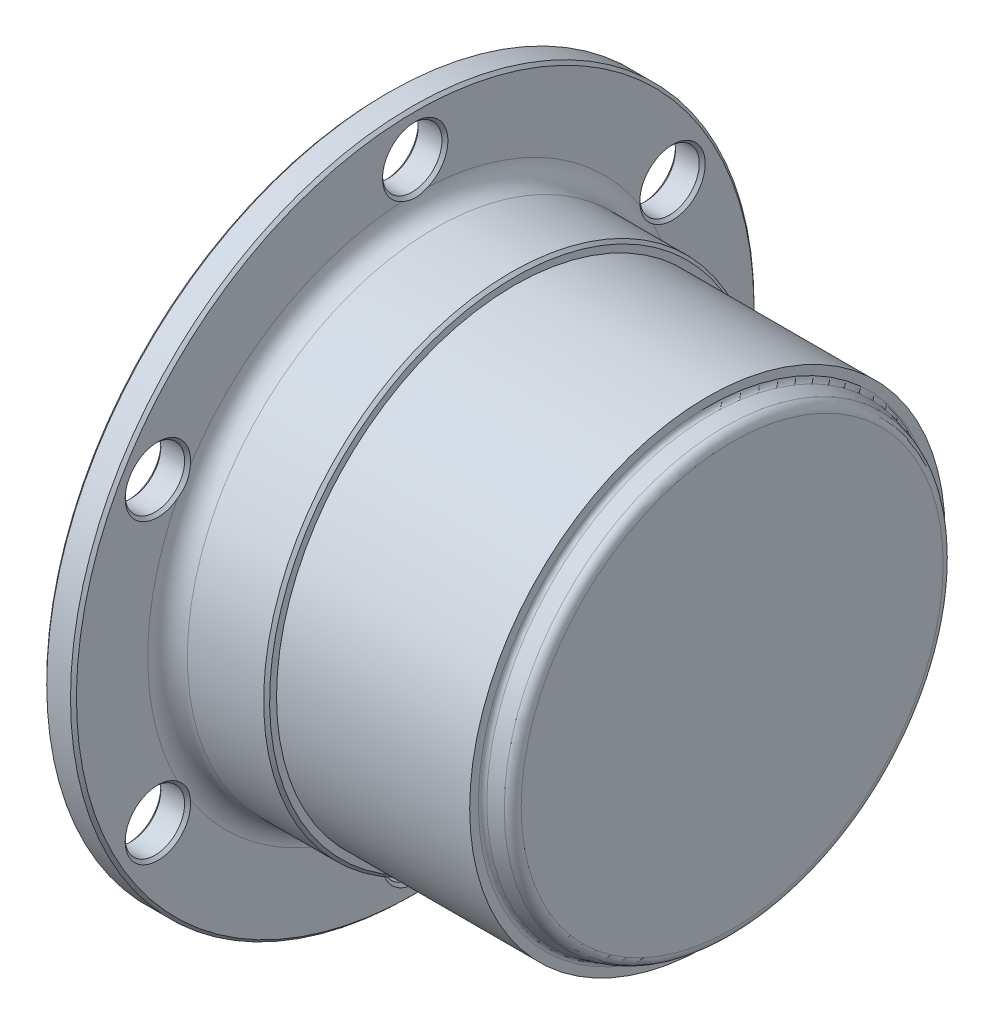
ISO-10303-21;
HEADER;
FILE_DESCRIPTION(('STEP AP214'),'2;1');
FILE_NAME('part.step','',(''),(''),'','','');
FILE_SCHEMA(('AUTOMOTIVE_DESIGN { 1 0 10303 214 1 1 1 1 }'));
ENDSEC;
DATA;
#1=APPLICATION_CONTEXT('core data for automotive mechanical design processes');
#2=APPLICATION_PROTOCOL_DEFINITION('international standard','automotive_design',2000,#1);
#3=PRODUCT_CONTEXT('',#1,'mechanical');
#4=PRODUCT('Part','Part','',(#3));
#5=PRODUCT_RELATED_PRODUCT_CATEGORY('part','',(#4));
#6=PRODUCT_DEFINITION_FORMATION('','',#4);
#7=PRODUCT_DEFINITION_CONTEXT('part definition',#1,'design');
#8=PRODUCT_DEFINITION('design','',#6,#7);
#9=PRODUCT_DEFINITION_SHAPE('','',#8);
#10=(LENGTH_UNIT() NAMED_UNIT(*) SI_UNIT(.MILLI.,.METRE.));
#11=(NAMED_UNIT(*) PLANE_ANGLE_UNIT() SI_UNIT($,.RADIAN.));
#12=(NAMED_UNIT(*) SI_UNIT($,.STERADIAN.) SOLID_ANGLE_UNIT());
#13=UNCERTAINTY_MEASURE_WITH_UNIT(LENGTH_MEASURE(1.E-05),#10,'distance_accuracy_value','');
#14=(GEOMETRIC_REPRESENTATION_CONTEXT(3) GLOBAL_UNCERTAINTY_ASSIGNED_CONTEXT((#13)) GLOBAL_UNIT_ASSIGNED_CONTEXT((#10,
#11,#12)) REPRESENTATION_CONTEXT('',''));
#15=CARTESIAN_POINT('',(0.,0.,0.));
#16=DIRECTION('',(0.,0.,1.));
#17=DIRECTION('',(1.,0.,0.));
#18=AXIS2_PLACEMENT_3D('',#15,#16,#17);
#19=CARTESIAN_POINT('',(35.,11.035,0.));
#20=DIRECTION('',(1.,0.,0.));
#21=DIRECTION('',(0.,0.,-1.));
#22=AXIS2_PLACEMENT_3D('',#19,#20,#21);
#23=PLANE('',#22);
#24=CARTESIAN_POINT('',(35.,0.,0.));
#25=DIRECTION('',(-1.,0.,0.));
#26=DIRECTION('',(0.,1.,0.));
#27=AXIS2_PLACEMENT_3D('',#24,#25,#26);
#28=CIRCLE('',#27,21.3030485192337);
#29=CARTESIAN_POINT('',(35.,21.3030485192337,0.));
#30=VERTEX_POINT('',#29);
#31=EDGE_CURVE('E331',#30,#30,#28,.T.);
#32=ORIENTED_EDGE('',*,*,#31,.F.);
#33=EDGE_LOOP('',(#32));
#34=FACE_BOUND('',#33,.T.);
#35=ADVANCED_FACE('F16',(#34),#23,.T.);
#36=CARTESIAN_POINT('',(34.,0.,0.));
#37=DIRECTION('',(1.,0.,0.));
#38=DIRECTION('',(0.,0.,-1.));
#39=AXIS2_PLACEMENT_3D('',#36,#37,#38);
#40=TOROIDAL_SURFACE('',#39,21.3030485192337,1.);
#41=ORIENTED_EDGE('',*,*,#31,.T.);
#42=EDGE_LOOP('',(#41));
#43=FACE_BOUND('',#42,.T.);
#44=CARTESIAN_POINT('',(34.2592756879301,0.,0.));
#45=DIRECTION('',(-1.,0.,0.));
#46=DIRECTION('',(0.,1.,0.));
#47=AXIS2_PLACEMENT_3D('',#44,#45,#46);
#48=CIRCLE('',#47,22.2688518729059);
#49=CARTESIAN_POINT('',(34.2592756879301,22.2688518729059,0.));
#50=VERTEX_POINT('',#49);
#51=EDGE_CURVE('E326',#50,#50,#48,.T.);
#52=ORIENTED_EDGE('',*,*,#51,.F.);
#53=EDGE_LOOP('',(#52));
#54=FACE_BOUND('',#53,.T.);
#55=ADVANCED_FACE('F346',(#43,#54),#40,.T.);
#56=CARTESIAN_POINT('',(32.8703621559847,0.,0.));
#57=DIRECTION('',(-1.,0.,0.));
#58=DIRECTION('',(0.,-1.,0.));
#59=AXIS2_PLACEMENT_3D('',#56,#57,#58);
#60=CONICAL_SURFACE('',#59,22.6417140188804,0.262272168863292);
#61=CARTESIAN_POINT('',(32.8703621560555,0.,0.));
#62=DIRECTION('',(-1.,0.,0.));
#63=DIRECTION('',(0.,0.,1.));
#64=AXIS2_PLACEMENT_3D('',#61,#62,#63);
#65=CIRCLE('',#64,22.641714019144);
#66=CARTESIAN_POINT('',(32.8703621560555,0.,22.641714019144));
#67=VERTEX_POINT('',#66);
#68=EDGE_CURVE('E322',#67,#67,#65,.T.);
#69=ORIENTED_EDGE('',*,*,#68,.F.);
#70=EDGE_LOOP('',(#69));
#71=FACE_BOUND('',#70,.T.);
#72=ORIENTED_EDGE('',*,*,#51,.T.);
#73=EDGE_LOOP('',(#72));
#74=FACE_BOUND('',#73,.T.);
#75=ADVANCED_FACE('F350',(#71,#74),#60,.T.);
#76=CARTESIAN_POINT('',(33.,0.,0.));
#77=DIRECTION('',(1.,0.,0.));
#78=DIRECTION('',(0.,0.,-1.));
#79=AXIS2_PLACEMENT_3D('',#76,#77,#78);
#80=TOROIDAL_SURFACE('',#79,23.1246156959038,0.500000000000003);
#81=ORIENTED_EDGE('',*,*,#68,.T.);
#82=EDGE_LOOP('',(#81));
#83=FACE_BOUND('',#82,.T.);
#84=CARTESIAN_POINT('',(32.5,0.,0.));
#85=DIRECTION('',(1.,0.,0.));
#86=DIRECTION('',(0.,0.,-1.));
#87=AXIS2_PLACEMENT_3D('',#84,#85,#86);
#88=CIRCLE('',#87,23.1246156959038);
#89=CARTESIAN_POINT('',(32.5,0.,-23.1246156959038));
#90=VERTEX_POINT('',#89);
#91=EDGE_CURVE('E20',#90,#90,#88,.F.);
#92=ORIENTED_EDGE('',*,*,#91,.F.);
#93=EDGE_LOOP('',(#92));
#94=FACE_BOUND('',#93,.T.);
#95=ADVANCED_FACE('F112',(#83,#94),#80,.F.);
#96=CARTESIAN_POINT('',(32.5,23.3705699777603,0.));
#97=DIRECTION('',(1.,0.,0.));
#98=DIRECTION('',(0.,0.,-1.));
#99=AXIS2_PLACEMENT_3D('',#96,#97,#98);
#100=PLANE('',#99);
#101=ORIENTED_EDGE('',*,*,#91,.T.);
#102=EDGE_LOOP('',(#101));
#103=FACE_BOUND('',#102,.T.);
#104=CARTESIAN_POINT('',(32.5,0.,0.));
#105=DIRECTION('',(1.,0.,0.));
#106=DIRECTION('',(0.,1.,0.));
#107=AXIS2_PLACEMENT_3D('',#104,#105,#106);
#108=CIRCLE('',#107,24.);
#109=CARTESIAN_POINT('',(32.5,24.,0.));
#110=VERTEX_POINT('',#109);
#111=EDGE_CURVE('E317',#110,#110,#108,.F.);
#112=ORIENTED_EDGE('',*,*,#111,.F.);
#113=EDGE_LOOP('',(#112));
#114=FACE_BOUND('',#113,.T.);
#115=ADVANCED_FACE('F612',(#103,#114),#100,.T.);
#116=CARTESIAN_POINT('',(22.75,0.,0.));
#117=DIRECTION('',(1.,0.,0.));
#118=DIRECTION('',(0.,1.,0.));
#119=AXIS2_PLACEMENT_3D('',#116,#117,#118);
#120=CYLINDRICAL_SURFACE('',#119,24.);
#121=CARTESIAN_POINT('',(13.,0.,0.));
#122=DIRECTION('',(1.,0.,0.));
#123=DIRECTION('',(0.,1.,0.));
#124=AXIS2_PLACEMENT_3D('',#121,#122,#123);
#125=CIRCLE('',#124,24.);
#126=CARTESIAN_POINT('',(13.,24.,0.));
#127=VERTEX_POINT('',#126);
#128=EDGE_CURVE('E315',#127,#127,#125,.F.);
#129=ORIENTED_EDGE('',*,*,#128,.F.);
#130=EDGE_LOOP('',(#129));
#131=FACE_BOUND('',#130,.T.);
#132=ORIENTED_EDGE('',*,*,#111,.T.);
#133=EDGE_LOOP('',(#132));
#134=FACE_BOUND('',#133,.T.);
#135=ADVANCED_FACE('F603',(#131,#134),#120,.T.);
#136=CARTESIAN_POINT('',(13.,24.5,0.));
#137=DIRECTION('',(1.,0.,0.));
#138=DIRECTION('',(0.,0.,-1.));
#139=AXIS2_PLACEMENT_3D('',#136,#137,#138);
#140=PLANE('',#139);
#141=ORIENTED_EDGE('',*,*,#128,.T.);
#142=EDGE_LOOP('',(#141));
#143=FACE_BOUND('',#142,.T.);
#144=CARTESIAN_POINT('',(13.0000000001346,0.,0.));
#145=DIRECTION('',(-1.,0.,0.));
#146=DIRECTION('',(0.,-1.,0.));
#147=AXIS2_PLACEMENT_3D('',#144,#145,#146);
#148=CIRCLE('',#147,24.7000000001346);
#149=CARTESIAN_POINT('',(13.0000000001346,-24.7000000001346,0.));
#150=VERTEX_POINT('',#149);
#151=EDGE_CURVE('E311',#150,#150,#148,.T.);
#152=ORIENTED_EDGE('',*,*,#151,.F.);
#153=EDGE_LOOP('',(#152));
#154=FACE_BOUND('',#153,.T.);
#155=ADVANCED_FACE('F595',(#143,#154),#140,.T.);
#156=CARTESIAN_POINT('',(12.6999999998654,0.,0.));
#157=DIRECTION('',(-1.,0.,0.));
#158=DIRECTION('',(0.,-1.,0.));
#159=AXIS2_PLACEMENT_3D('',#156,#157,#158);
#160=CONICAL_SURFACE('',#159,24.9999999998654,0.785398162499989);
#161=ORIENTED_EDGE('',*,*,#151,.T.);
#162=EDGE_LOOP('',(#161));
#163=FACE_BOUND('',#162,.T.);
#164=CARTESIAN_POINT('',(12.7,0.,0.));
#165=DIRECTION('',(1.,0.,0.));
#166=DIRECTION('',(0.,1.,0.));
#167=AXIS2_PLACEMENT_3D('',#164,#165,#166);
#168=CIRCLE('',#167,25.);
#169=CARTESIAN_POINT('',(12.7,25.,0.));
#170=VERTEX_POINT('',#169);
#171=EDGE_CURVE('E314',#170,#170,#168,.F.);
#172=ORIENTED_EDGE('',*,*,#171,.F.);
#173=EDGE_LOOP('',(#172));
#174=FACE_BOUND('',#173,.T.);
#175=ADVANCED_FACE('F587',(#163,#174),#160,.T.);
#176=CARTESIAN_POINT('',(8.,0.,0.));
#177=DIRECTION('',(1.,0.,0.));
#178=DIRECTION('',(0.,1.,0.));
#179=AXIS2_PLACEMENT_3D('',#176,#177,#178);
#180=CYLINDRICAL_SURFACE('',#179,25.);
#181=CARTESIAN_POINT('',(5.00000000000002,0.,0.));
#182=DIRECTION('',(-1.,0.,0.));
#183=DIRECTION('',(0.,-1.,0.));
#184=AXIS2_PLACEMENT_3D('',#181,#182,#183);
#185=CIRCLE('',#184,25.);
#186=CARTESIAN_POINT('',(5.00000000000003,-25.,0.));
#187=VERTEX_POINT('',#186);
#188=EDGE_CURVE('E255',#187,#187,#185,.T.);
#189=ORIENTED_EDGE('',*,*,#188,.F.);
#190=EDGE_LOOP('',(#189));
#191=FACE_BOUND('',#190,.T.);
#192=ORIENTED_EDGE('',*,*,#171,.T.);
#193=EDGE_LOOP('',(#192));
#194=FACE_BOUND('',#193,.T.);
#195=ADVANCED_FACE('F110',(#191,#194),#180,.T.);
#196=CARTESIAN_POINT('',(5.00000000000001,0.,0.));
#197=DIRECTION('',(1.,0.,0.));
#198=DIRECTION('',(0.,1.,0.));
#199=AXIS2_PLACEMENT_3D('',#196,#197,#198);
#200=TOROIDAL_SURFACE('',#199,27.,2.);
#201=ORIENTED_EDGE('',*,*,#188,.T.);
#202=EDGE_LOOP('',(#201));
#203=FACE_BOUND('',#202,.T.);
#204=CARTESIAN_POINT('',(2.99999999995298,-14.6134115529089,-22.7034843757013));
#205=CARTESIAN_POINT('',(2.99998620749877,-14.5138441669958,-22.7152308397187));
#206=CARTESIAN_POINT('',(3.00145679800519,-14.4145564656125,-22.7300789297684));
#207=CARTESIAN_POINT('',(3.00595035275069,-14.2170991218604,-22.7672776914105));
#208=CARTESIAN_POINT('',(3.00897853739993,-14.118934381455,-22.7896535050073));
#209=CARTESIAN_POINT('',(3.01511705665506,-13.9260551494247,-22.842844116466));
#210=CARTESIAN_POINT('',(3.01822608607643,-13.8313142851505,-22.873561278158));
#211=CARTESIAN_POINT('',(3.02327324574541,-13.645506776664,-22.944423134913));
#212=CARTESIAN_POINT('',(3.02521305551498,-13.5544350383982,-22.9845541916645));
#213=CARTESIAN_POINT('',(3.02710996749349,-13.3799725135054,-23.0731107581484));
#214=CARTESIAN_POINT('',(3.02712753047093,-13.2964302158114,-23.121235578203));
#215=CARTESIAN_POINT('',(3.02532574275154,-13.1348805397073,-23.226057479384));
#216=CARTESIAN_POINT('',(3.02350535997505,-13.0568762974766,-23.282759361663));
#217=CARTESIAN_POINT('',(3.01872668445837,-12.9069195400655,-23.4035110818553));
#218=CARTESIAN_POINT('',(3.01576884926198,-12.8349646056965,-23.4675579579615));
#219=CARTESIAN_POINT('',(3.0098515449938,-12.6968966417,-23.6016680679122));
#220=CARTESIAN_POINT('',(3.0068920756999,-12.6307854335572,-23.6717331643068));
#221=CARTESIAN_POINT('',(3.00320497024905,-12.5301732014046,-23.7866096397889));
#222=CARTESIAN_POINT('',(3.00206049059253,-12.4939055070713,-23.8298831212093));
#223=CARTESIAN_POINT('',(3.00045804768513,-12.4231966920173,-23.9176879716895));
#224=CARTESIAN_POINT('',(2.99999794669206,-12.3887502090597,-23.962214979259));
#225=CARTESIAN_POINT('',(3.00000000000001,-12.35508844734,-24.0073278286405));
#226=B_SPLINE_CURVE_WITH_KNOTS('',3,(#204,#205,#206,#207,#208,#209,#210,#211,#212,#213,#214,
#215,#216,#217,#218,#219,#220,#221,#222,#223,#224,#225),.UNSPECIFIED.,.F.,.F.,(4,2,2,2,2,2,2,2,
2,2,4),(0.,0.300849664736547,0.602714287443657,0.901187468211775,1.19923087995564,
1.48789709636574,1.77672550054645,2.065437843926,2.35423986368744,2.52361852068753,
2.6924669830521),.UNSPECIFIED.);
#227=CARTESIAN_POINT('',(3.00000000004979,-14.6134115528892,-22.7034843755346));
#228=VERTEX_POINT('',#227);
#229=CARTESIAN_POINT('',(3.,-12.3550884472313,-24.0073278285561));
#230=VERTEX_POINT('',#229);
#231=EDGE_CURVE('E128',#228,#230,#226,.T.);
#232=ORIENTED_EDGE('',*,*,#231,.T.);
#233=CARTESIAN_POINT('',(3.,12.355088447121,-24.0073278284739));
#234=CARTESIAN_POINT('',(3.,9.5301077884236,-25.4610296408908));
#235=CARTESIAN_POINT('',(3.,6.44544859354531,-26.2193858133245));
#236=CARTESIAN_POINT('',(3.,3.27050867899624,-26.9999372873098));
#237=CARTESIAN_POINT('',(3.,0.,-27.));
#238=CARTESIAN_POINT('',(3.,-3.26948081166682,-27.0000626929806));
#239=CARTESIAN_POINT('',(3.,-6.44544859354535,-26.2193858133245));
#240=CARTESIAN_POINT('',(3.,-9.52964780957904,-25.4612663405928));
#241=CARTESIAN_POINT('',(3.,-12.3550884471211,-24.0073278284738));
#242=B_SPLINE_CURVE_WITH_KNOTS('',2,(#233,#234,#235,#236,#237,#238,#239,#240,#241),
.UNSPECIFIED.,.F.,.F.,(3,2,2,2,3),(0.,0.25,0.5,0.75,1.),.UNSPECIFIED.);
#243=CARTESIAN_POINT('',(3.00000000010664,12.3550884471812,-24.0073278285187));
#244=VERTEX_POINT('',#243);
#245=EDGE_CURVE('E284',#244,#230,#242,.T.);
#246=ORIENTED_EDGE('',*,*,#245,.F.);
#247=CARTESIAN_POINT('',(2.99999999994965,12.3550884473956,-24.0073278286787));
#248=CARTESIAN_POINT('',(2.99998620749584,12.415044876597,-23.926973175101));
#249=CARTESIAN_POINT('',(3.00145679800134,12.4775475504703,-23.8484115484471));
#250=CARTESIAN_POINT('',(3.00595035274397,12.608491294919,-23.69600785342));
#251=CARTESIAN_POINT('',(3.00897853739124,12.6769516881273,-23.6221826012737));
#252=CARTESIAN_POINT('',(3.01511705664302,12.8194557249094,-23.481739592207));
#253=CARTESIAN_POINT('',(3.018226086063,12.8934279994044,-23.4150501778172));
#254=CARTESIAN_POINT('',(3.02327324572964,13.0476999217573,-23.2895670836356));
#255=CARTESIAN_POINT('',(3.02521305549826,13.1279903055177,-23.2307621731083));
#256=CARTESIAN_POINT('',(3.02710996747569,13.2919138042112,-23.1239514777875));
#257=CARTESIAN_POINT('',(3.02712753045296,13.3753622697781,-23.0756641357222));
#258=CARTESIAN_POINT('',(3.02532574273398,13.5469155371259,-22.9881689628348));
#259=CARTESIAN_POINT('',(3.02350535995807,13.635022928737,-22.9489662485999));
#260=CARTESIAN_POINT('',(3.01872668444322,13.8145753646791,-22.8794757473094));
#261=CARTESIAN_POINT('',(3.01576884924807,13.9060190536042,-22.8491843842712));
#262=CARTESIAN_POINT('',(3.00985154498287,14.0911957977231,-22.7966690749764));
#263=CARTESIAN_POINT('',(3.00689207569069,14.1849295551903,-22.7744476374468));
#264=CARTESIAN_POINT('',(3.0032049702431,14.3347216173207,-22.7447531262135));
#265=CARTESIAN_POINT('',(3.00206049058792,14.3903313986974,-22.7349811222957));
#266=CARTESIAN_POINT('',(3.000458047683,14.5017270372951,-22.7176479174294));
#267=CARTESIAN_POINT('',(2.99999794669108,14.5575117984733,-22.7100798919024));
#268=CARTESIAN_POINT('',(3.,14.6134115529243,-22.703484375808));
#269=B_SPLINE_CURVE_WITH_KNOTS('',3,(#247,#248,#249,#250,#251,#252,#253,#254,#255,#256,#257,
#258,#259,#260,#261,#262,#263,#264,#265,#266,#267,#268),.UNSPECIFIED.,.F.,.F.,(4,2,2,2,2,2,2,2,
2,2,4),(0.,0.300849664732203,0.602714287434719,0.901187468199439,1.19923087994002,
1.48789709634906,1.77672550052869,2.06543784390696,2.35423986366708,2.5236185206361,
2.69246698296985),.UNSPECIFIED.);
#270=CARTESIAN_POINT('',(3.,14.6134115529002,-22.7034843756279));
#271=VERTEX_POINT('',#270);
#272=EDGE_CURVE('E136',#244,#271,#269,.T.);
#273=ORIENTED_EDGE('',*,*,#272,.T.);
#274=CARTESIAN_POINT('',(3.,26.9685,-1.30384345302645));
#275=CARTESIAN_POINT('',(3.,26.8149523697336,-4.47719937482904));
#276=CARTESIAN_POINT('',(3.,25.929378482737,-7.52777068586533));
#277=CARTESIAN_POINT('',(3.,25.0178859309052,-10.6676250443442));
#278=CARTESIAN_POINT('',(3.,23.3826859021798,-13.5));
#279=CARTESIAN_POINT('',(3.,21.7479997900146,-16.3314847866435));
#280=CARTESIAN_POINT('',(3.,19.4839298891917,-18.6916151274592));
#281=CARTESIAN_POINT('',(3.,17.2852795586453,-20.9835502625365));
#282=CARTESIAN_POINT('',(3.,14.6134115528789,-22.7034843754474));
#283=B_SPLINE_CURVE_WITH_KNOTS('',2,(#274,#275,#276,#277,#278,#279,#280,#281,#282),
.UNSPECIFIED.,.F.,.F.,(3,2,2,2,3),(0.,0.25,0.5,0.75,1.),.UNSPECIFIED.);
#284=CARTESIAN_POINT('',(3.00000000004979,26.9685000000445,-1.30384345300732));
#285=VERTEX_POINT('',#284);
#286=EDGE_CURVE('E281',#285,#271,#283,.T.);
#287=ORIENTED_EDGE('',*,*,#286,.F.);
#288=CARTESIAN_POINT('',(2.99999999997061,26.9685000001693,-1.30384345295365));
#289=CARTESIAN_POINT('',(2.99998620750666,26.9288890434502,-1.21174233535718));
#290=CARTESIAN_POINT('',(3.00145679801001,26.8921040159358,-1.1183326186514));
#291=CARTESIAN_POINT('',(3.00595035275516,26.8255904166264,-0.928730161977144));
#292=CARTESIAN_POINT('',(3.00897853740713,26.7958860694277,-0.832529096231325));
#293=CARTESIAN_POINT('',(3.01511705666584,26.7455108741759,-0.638895475700679));
#294=CARTESIAN_POINT('',(3.01822608608809,26.7247422843946,-0.541488899616608));
#295=CARTESIAN_POINT('',(3.02327324575881,26.6932066982577,-0.345143948675367));
#296=CARTESIAN_POINT('',(3.02521305552925,26.6824253437511,-0.246207981394241));
#297=CARTESIAN_POINT('',(3.02710996750877,26.6718863175495,-0.0508407195854889));
#298=CARTESIAN_POINT('',(3.02712753048637,26.6717924854213,0.045571442536137));
#299=CARTESIAN_POINT('',(3.02532574276669,26.6817960766636,0.237888516607716));
#300=CARTESIAN_POINT('',(3.02350535998974,26.6918992260437,0.33379311312281));
#301=CARTESIAN_POINT('',(3.01872668447157,26.7214949045749,0.524035334607838));
#302=CARTESIAN_POINT('',(3.01576884927412,26.7409836591313,0.618373573753044));
#303=CARTESIAN_POINT('',(3.0098515450034,26.7880924392549,0.804998992999827));
#304=CARTESIAN_POINT('',(3.00689207570798,26.8157149885801,0.89728552692442));
#305=CARTESIAN_POINT('',(3.00320497025429,26.8648948185719,1.04185651365006));
#306=CARTESIAN_POINT('',(3.0020604905966,26.8842369056288,1.09490199899766));
#307=CARTESIAN_POINT('',(3.00045804768701,26.9249237292004,1.20004005436183));
#308=CARTESIAN_POINT('',(2.99999794669293,26.9462620074353,1.25213508746662));
#309=CARTESIAN_POINT('',(3.,26.9685000001811,1.30384345295036));
#310=B_SPLINE_CURVE_WITH_KNOTS('',3,(#288,#289,#290,#291,#292,#293,#294,#295,#296,#297,#298,
#299,#300,#301,#302,#303,#304,#305,#306,#307,#308,#309),.UNSPECIFIED.,.F.,.F.,(4,2,2,2,2,2,2,2,
2,2,4),(0.,0.300849664739236,0.602714287448735,0.901187468218406,1.19923087996389,
1.48789709637645,1.77672550055958,2.06543784394173,2.35423986370581,2.52361852073209,
2.69246698312263),.UNSPECIFIED.);
#311=CARTESIAN_POINT('',(3.,26.9685000000902,1.30384345298764));
#312=VERTEX_POINT('',#311);
#313=EDGE_CURVE('E88',#285,#312,#310,.T.);
#314=ORIENTED_EDGE('',*,*,#313,.T.);
#315=CARTESIAN_POINT('',(3.,14.6134115528789,22.7034843754474));
#316=CARTESIAN_POINT('',(3.,17.2848445812511,20.9838302660609));
#317=CARTESIAN_POINT('',(3.,19.4839298891917,18.6916151274592));
#318=CARTESIAN_POINT('',(3.,21.7473772518397,16.3323122430483));
#319=CARTESIAN_POINT('',(3.,23.3826859021798,13.5));
#320=CARTESIAN_POINT('',(3.,25.0174806017823,10.6685779063228));
#321=CARTESIAN_POINT('',(3.,25.929378482737,7.52777068586533));
#322=CARTESIAN_POINT('',(3.,26.8149273682708,4.47771607795173));
#323=CARTESIAN_POINT('',(3.,26.9685,1.30384345302645));
#324=B_SPLINE_CURVE_WITH_KNOTS('',2,(#315,#316,#317,#318,#319,#320,#321,#322,#323),
.UNSPECIFIED.,.F.,.F.,(3,2,2,2,3),(0.,0.25,0.5,0.75,1.),.UNSPECIFIED.);
#325=CARTESIAN_POINT('',(3.00000000007822,14.6134115528899,22.7034843755404));
#326=VERTEX_POINT('',#325);
#327=EDGE_CURVE('E71',#326,#312,#324,.T.);
#328=ORIENTED_EDGE('',*,*,#327,.F.);
#329=CARTESIAN_POINT('',(2.99999999994472,14.6134115529165,22.703484375766));
#330=CARTESIAN_POINT('',(2.99998620749446,14.513844167008,22.7152308397864));
#331=CARTESIAN_POINT('',(3.00145679800156,14.414556465629,22.730078929838));
#332=CARTESIAN_POINT('',(3.00595035274564,14.2170991218857,22.7672776914825));
#333=CARTESIAN_POINT('',(3.00897853739275,14.1189343814847,22.7896535050798));
#334=CARTESIAN_POINT('',(3.01511705664463,13.9260551494624,22.8428441165393));
#335=CARTESIAN_POINT('',(3.01822608606487,13.8313142851919,22.8735612782316));
#336=CARTESIAN_POINT('',(3.02327324573198,13.6455067767124,22.944423134986));
#337=CARTESIAN_POINT('',(3.0252130555008,13.55443503845,22.9845541917367));
#338=CARTESIAN_POINT('',(3.02710996747874,13.3799725135608,23.0731107582186));
#339=CARTESIAN_POINT('',(3.02712753045627,13.2964302158672,23.1212355782724));
#340=CARTESIAN_POINT('',(3.0253257427377,13.1348805397633,23.2260574794513));
#341=CARTESIAN_POINT('',(3.02350535996193,13.0568762975324,23.2827593617288));
#342=CARTESIAN_POINT('',(3.01872668444715,12.9069195401206,23.4035110819178));
#343=CARTESIAN_POINT('',(3.01576884925191,12.834964605751,23.4675579580222));
#344=CARTESIAN_POINT('',(3.00985154498625,12.6968966417531,23.6016680679692));
#345=CARTESIAN_POINT('',(3.00689207569369,12.6307854336096,23.671733164362));
#346=CARTESIAN_POINT('',(3.00320497024504,12.5301732014567,23.7866096398403));
#347=CARTESIAN_POINT('',(3.00206049058935,12.493905507124,23.8298831212587));
#348=CARTESIAN_POINT('',(3.00045804768357,12.423196692071,23.9176879717348));
#349=CARTESIAN_POINT('',(2.99999794669129,12.3887502091139,23.9622149793023));
#350=CARTESIAN_POINT('',(3.,12.3550884473947,24.0073278286818));
#351=B_SPLINE_CURVE_WITH_KNOTS('',3,(#329,#330,#331,#332,#333,#334,#335,#336,#337,#338,#339,
#340,#341,#342,#343,#344,#345,#346,#347,#348,#349,#350),.UNSPECIFIED.,.F.,.F.,(4,2,2,2,2,2,2,2,
2,2,4),(0.,0.300849664724391,0.602714287418975,0.901187468176801,1.19923087991055,
1.48789709631857,1.77672550049714,2.06543784387428,2.35423986363326,2.52361852062752,
2.69246698298644),.UNSPECIFIED.);
#352=CARTESIAN_POINT('',(3.,12.3550884472588,24.0073278285766));
#353=VERTEX_POINT('',#352);
#354=EDGE_CURVE('E64',#326,#353,#351,.T.);
#355=ORIENTED_EDGE('',*,*,#354,.T.);
#356=CARTESIAN_POINT('',(3.,-12.3550884471211,24.0073278284739));
#357=CARTESIAN_POINT('',(3.,-9.53010778846972,25.461029640867));
#358=CARTESIAN_POINT('',(3.,-6.44544859354534,26.2193858133245));
#359=CARTESIAN_POINT('',(3.,-3.27050867895907,26.9999372873318));
#360=CARTESIAN_POINT('',(3.,0.,27.));
#361=CARTESIAN_POINT('',(3.,3.26948081166127,27.0000626929587));
#362=CARTESIAN_POINT('',(3.,6.44544859354534,26.2193858133245));
#363=CARTESIAN_POINT('',(3.,9.52964780949479,25.4612663406361));
#364=CARTESIAN_POINT('',(3.,12.3550884471211,24.0073278284738));
#365=B_SPLINE_CURVE_WITH_KNOTS('',2,(#356,#357,#358,#359,#360,#361,#362,#363,#364),
.UNSPECIFIED.,.F.,.F.,(3,2,2,2,3),(0.,0.25,0.5,0.75,1.),.UNSPECIFIED.);
#366=CARTESIAN_POINT('',(3.00000000007822,-12.3550884471922,24.0073278285269));
#367=VERTEX_POINT('',#366);
#368=EDGE_CURVE('E68',#367,#353,#365,.T.);
#369=ORIENTED_EDGE('',*,*,#368,.F.);
#370=CARTESIAN_POINT('',(2.99999999994972,-12.3550884473719,24.007327828661));
#371=CARTESIAN_POINT('',(2.99998620749645,-12.4150448765726,23.9269731750834));
#372=CARTESIAN_POINT('',(3.0014567980025,-12.4775475504451,23.8484115484295));
#373=CARTESIAN_POINT('',(3.00595035274619,-12.6084912948922,23.6960078534025));
#374=CARTESIAN_POINT('',(3.00897853739398,-12.6769516880996,23.6221826012563));
#375=CARTESIAN_POINT('',(3.01511705664669,-12.81945572488,23.4817395921894));
#376=CARTESIAN_POINT('',(3.0182260860671,-12.8934279993742,23.4150501777995));
#377=CARTESIAN_POINT('',(3.02327324573448,-13.0476999217254,23.2895670836175));
#378=CARTESIAN_POINT('',(3.02521305550342,-13.1279903054849,23.2307621730899));
#379=CARTESIAN_POINT('',(3.0271099674813,-13.2919138041772,23.1239514777681));
#380=CARTESIAN_POINT('',(3.0271275304587,-13.3753622697437,23.0756641357022));
#381=CARTESIAN_POINT('',(3.02532574273977,-13.5469155370909,22.9881689628136));
#382=CARTESIAN_POINT('',(3.02350535996376,-13.6350229287017,22.9489662485782));
#383=CARTESIAN_POINT('',(3.01872668444847,-13.8145753646434,22.8794757472866));
#384=CARTESIAN_POINT('',(3.01576884925297,-13.9060190535684,22.8491843842479));
#385=CARTESIAN_POINT('',(3.00985154498685,-14.091195797687,22.7966690749522));
#386=CARTESIAN_POINT('',(3.0068920756941,-14.1849295551542,22.7744476374223));
#387=CARTESIAN_POINT('',(3.00320497024531,-14.3347216172899,22.7447531261875));
#388=CARTESIAN_POINT('',(3.00206049058961,-14.390331398672,22.7349811222687));
#389=CARTESIAN_POINT('',(3.00045804768375,-14.5017270372807,22.7176479174009));
#390=CARTESIAN_POINT('',(2.99999794669141,-14.5575117984644,22.7100798918733));
#391=CARTESIAN_POINT('',(3.00000000000001,-14.6134115529209,22.7034843757786));
#392=B_SPLINE_CURVE_WITH_KNOTS('',3,(#370,#371,#372,#373,#374,#375,#376,#377,#378,#379,#380,
#381,#382,#383,#384,#385,#386,#387,#388,#389,#390,#391),.UNSPECIFIED.,.F.,.F.,(4,2,2,2,2,2,2,2,
2,2,4),(0.,0.30084966473057,0.602714287431443,0.901187468194582,1.19923087993358,
1.48789709634264,1.77672550052227,2.06543784390057,2.35423986366073,2.52361852064635,
2.69246698299661),.UNSPECIFIED.);
#393=CARTESIAN_POINT('',(3.00000000000001,-14.6134115528985,22.7034843756132));
#394=VERTEX_POINT('',#393);
#395=EDGE_CURVE('E303',#367,#394,#392,.T.);
#396=ORIENTED_EDGE('',*,*,#395,.T.);
#397=CARTESIAN_POINT('',(3.,-26.9685,1.30384345302645));
#398=CARTESIAN_POINT('',(3.,-26.8149523697329,4.47719937484393));
#399=CARTESIAN_POINT('',(3.,-25.929378482737,7.52777068586535));
#400=CARTESIAN_POINT('',(3.,-25.0178859309412,10.6676250442074));
#401=CARTESIAN_POINT('',(3.,-23.3826859021798,13.5));
#402=CARTESIAN_POINT('',(3.,-21.7479997901208,16.3314847865341));
#403=CARTESIAN_POINT('',(3.,-19.4839298891917,18.6916151274592));
#404=CARTESIAN_POINT('',(3.,-17.2852795586425,20.9835502625382));
#405=CARTESIAN_POINT('',(3.,-14.6134115528789,22.7034843754474));
#406=B_SPLINE_CURVE_WITH_KNOTS('',2,(#397,#398,#399,#400,#401,#402,#403,#404,#405),
.UNSPECIFIED.,.F.,.F.,(3,2,2,2,3),(0.,0.25,0.5,0.75,1.),.UNSPECIFIED.);
#407=CARTESIAN_POINT('',(3.00000000007822,-26.9685000000184,1.30384345301855));
#408=VERTEX_POINT('',#407);
#409=EDGE_CURVE('E84',#408,#394,#406,.T.);
#410=ORIENTED_EDGE('',*,*,#409,.F.);
#411=CARTESIAN_POINT('',(2.99999999997773,-26.9685000001719,1.3038434529525));
#412=CARTESIAN_POINT('',(2.99998620750923,-26.9288890434509,1.21174233535604));
#413=CARTESIAN_POINT('',(3.00145679801073,-26.8921040159355,1.11833261864989));
#414=CARTESIAN_POINT('',(3.00595035275456,-26.8255904166253,0.928730161974571));
#415=CARTESIAN_POINT('',(3.00897853740707,-26.7958860694266,0.832529096228062));
#416=CARTESIAN_POINT('',(3.01511705666618,-26.745510874175,0.638895475696191));
#417=CARTESIAN_POINT('',(3.01822608608831,-26.7247422843936,0.541488899611587));
#418=CARTESIAN_POINT('',(3.02327324575892,-26.6932066982569,0.34514394866924));
#419=CARTESIAN_POINT('',(3.02521305552936,-26.6824253437505,0.246207981387541));
#420=CARTESIAN_POINT('',(3.02710996750883,-26.6718863175493,0.0508407195779068));
#421=CARTESIAN_POINT('',(3.02712753048636,-26.6717924854214,-0.0455714425440295));
#422=CARTESIAN_POINT('',(3.02532574276657,-26.6817960766643,-0.237888516616191));
#423=CARTESIAN_POINT('',(3.02350535998958,-26.6918992260448,-0.333793113131556));
#424=CARTESIAN_POINT('',(3.01872668447132,-26.7214949045766,-0.524035334617105));
#425=CARTESIAN_POINT('',(3.01576884927384,-26.7409836591334,-0.61837357376256));
#426=CARTESIAN_POINT('',(3.00985154500309,-26.7880924392577,-0.804998993009812));
#427=CARTESIAN_POINT('',(3.00689207570769,-26.8157149885833,-0.897285526934626));
#428=CARTESIAN_POINT('',(3.00320497025411,-26.8648948185749,-1.04185651365862));
#429=CARTESIAN_POINT('',(3.00206049059649,-26.8842369056313,-1.0949019990044));
#430=CARTESIAN_POINT('',(3.000458047687,-26.9249237292017,-1.20004005436498));
#431=CARTESIAN_POINT('',(2.99999794669295,-26.9462620074359,-1.252135087468));
#432=CARTESIAN_POINT('',(3.00000000000002,-26.9685000001809,-1.30384345295));
#433=B_SPLINE_CURVE_WITH_KNOTS('',3,(#411,#412,#413,#414,#415,#416,#417,#418,#419,#420,#421,
#422,#423,#424,#425,#426,#427,#428,#429,#430,#431,#432),.UNSPECIFIED.,.F.,.F.,(4,2,2,2,2,2,2,2,
2,2,4),(0.,0.300849664741245,0.602714287452606,0.901187468223862,1.19923087997097,
1.48789709638446,1.77672550056851,2.06543784395161,2.35423986371662,2.5236185207372,
2.69246698312205),.UNSPECIFIED.);
#434=CARTESIAN_POINT('',(3.00000000000001,-26.9685000000902,-1.30384345298764));
#435=VERTEX_POINT('',#434);
#436=EDGE_CURVE('E35',#408,#435,#433,.T.);
#437=ORIENTED_EDGE('',*,*,#436,.T.);
#438=CARTESIAN_POINT('',(3.,-14.6134115528789,-22.7034843754474));
#439=CARTESIAN_POINT('',(3.,-17.2848445812793,-20.9838302660428));
#440=CARTESIAN_POINT('',(3.,-19.4839298891917,-18.6916151274592));
#441=CARTESIAN_POINT('',(3.,-21.7473772518644,-16.3323122430109));
#442=CARTESIAN_POINT('',(3.,-23.3826859021798,-13.5));
#443=CARTESIAN_POINT('',(3.,-25.0174806017236,-10.6685779064189));
#444=CARTESIAN_POINT('',(3.,-25.929378482737,-7.52777068586533));
#445=CARTESIAN_POINT('',(3.,-26.8149273682649,-4.47771607807518));
#446=CARTESIAN_POINT('',(3.,-26.9685,-1.30384345302645));
#447=B_SPLINE_CURVE_WITH_KNOTS('',2,(#438,#439,#440,#441,#442,#443,#444,#445,#446),
.UNSPECIFIED.,.F.,.F.,(3,2,2,2,3),(0.,0.25,0.5,0.75,1.),.UNSPECIFIED.);
#448=EDGE_CURVE('E272',#228,#435,#447,.T.);
#449=ORIENTED_EDGE('',*,*,#448,.F.);
#450=EDGE_LOOP('',(#232,#246,#273,#287,#314,#328,#355,#369,#396,#410,#437,#449));
#451=FACE_BOUND('',#450,.T.);
#452=ADVANCED_FACE('F66',(#203,#451),#200,.F.);
#453=CARTESIAN_POINT('',(3.,29.75,0.));
#454=DIRECTION('',(1.,0.,0.));
#455=DIRECTION('',(0.,0.,-1.));
#456=AXIS2_PLACEMENT_3D('',#453,#454,#455);
#457=PLANE('',#456);
#458=ORIENTED_EDGE('',*,*,#448,.T.);
#459=CARTESIAN_POINT('',(3.00000000015643,-30.,0.));
#460=DIRECTION('',(1.,0.,0.));
#461=DIRECTION('',(0.,0.,-1.));
#462=AXIS2_PLACEMENT_3D('',#459,#460,#461);
#463=CIRCLE('',#462,3.29999999996001);
#464=EDGE_CURVE('E250',#435,#408,#463,.F.);
#465=ORIENTED_EDGE('',*,*,#464,.T.);
#466=ORIENTED_EDGE('',*,*,#409,.T.);
#467=CARTESIAN_POINT('',(3.00000000015643,-15.,25.9807621135332));
#468=DIRECTION('',(1.,0.,0.));
#469=DIRECTION('',(0.,0.,-1.));
#470=AXIS2_PLACEMENT_3D('',#467,#468,#469);
#471=CIRCLE('',#470,3.29999999982259);
#472=EDGE_CURVE('E76',#394,#367,#471,.F.);
#473=ORIENTED_EDGE('',*,*,#472,.T.);
#474=ORIENTED_EDGE('',*,*,#368,.T.);
#475=CARTESIAN_POINT('',(3.00000000015643,15.,25.9807621135332));
#476=DIRECTION('',(1.,0.,0.));
#477=DIRECTION('',(0.,0.,-1.));
#478=AXIS2_PLACEMENT_3D('',#475,#476,#477);
#479=CIRCLE('',#478,3.29999999981273);
#480=EDGE_CURVE('E75',#353,#326,#479,.F.);
#481=ORIENTED_EDGE('',*,*,#480,.T.);
#482=ORIENTED_EDGE('',*,*,#327,.T.);
#483=CARTESIAN_POINT('',(3.00000000009959,30.,0.));
#484=DIRECTION('',(1.,0.,0.));
#485=DIRECTION('',(0.,0.,-1.));
#486=AXIS2_PLACEMENT_3D('',#483,#484,#485);
#487=CIRCLE('',#486,3.29999999990316);
#488=EDGE_CURVE('E90',#312,#285,#487,.F.);
#489=ORIENTED_EDGE('',*,*,#488,.T.);
#490=ORIENTED_EDGE('',*,*,#286,.T.);
#491=CARTESIAN_POINT('',(3.00000000021328,15.,-25.9807621135332));
#492=DIRECTION('',(1.,0.,0.));
#493=DIRECTION('',(0.,0.,-1.));
#494=AXIS2_PLACEMENT_3D('',#491,#492,#493);
#495=CIRCLE('',#494,3.29999999984989);
#496=EDGE_CURVE('E141',#271,#244,#495,.F.);
#497=ORIENTED_EDGE('',*,*,#496,.T.);
#498=ORIENTED_EDGE('',*,*,#245,.T.);
#499=CARTESIAN_POINT('',(3.00000000009959,-15.,-25.9807621135332));
#500=DIRECTION('',(1.,0.,0.));
#501=DIRECTION('',(0.,0.,-1.));
#502=AXIS2_PLACEMENT_3D('',#499,#500,#501);
#503=CIRCLE('',#502,3.29999999982446);
#504=EDGE_CURVE('E382',#230,#228,#503,.F.);
#505=ORIENTED_EDGE('',*,*,#504,.T.);
#506=EDGE_LOOP('',(#458,#465,#466,#473,#474,#481,#482,#489,#490,#497,#498,#505));
#507=FACE_BOUND('',#506,.T.);
#508=CARTESIAN_POINT('',(3.00000000013463,0.,0.));
#509=DIRECTION('',(-1.,0.,0.));
#510=DIRECTION('',(0.,-1.,0.));
#511=AXIS2_PLACEMENT_3D('',#508,#509,#510);
#512=CIRCLE('',#511,34.2000000001346);
#513=CARTESIAN_POINT('',(3.00000000013464,-34.2000000001346,0.));
#514=VERTEX_POINT('',#513);
#515=EDGE_CURVE('E300',#514,#514,#512,.T.);
#516=ORIENTED_EDGE('',*,*,#515,.F.);
#517=EDGE_LOOP('',(#516));
#518=FACE_BOUND('',#517,.T.);
#519=ADVANCED_FACE('F79',(#507,#518),#457,.T.);
#520=CARTESIAN_POINT('',(2.69999999986539,0.,0.));
#521=DIRECTION('',(-1.,0.,0.));
#522=DIRECTION('',(0.,-1.,0.));
#523=AXIS2_PLACEMENT_3D('',#520,#521,#522);
#524=CONICAL_SURFACE('',#523,34.4999999998654,0.785398162499984);
#525=ORIENTED_EDGE('',*,*,#515,.T.);
#526=EDGE_LOOP('',(#525));
#527=FACE_BOUND('',#526,.T.);
#528=CARTESIAN_POINT('',(2.70000000000001,0.,0.));
#529=DIRECTION('',(1.,0.,0.));
#530=DIRECTION('',(0.,1.,0.));
#531=AXIS2_PLACEMENT_3D('',#528,#529,#530);
#532=CIRCLE('',#531,34.5);
#533=CARTESIAN_POINT('',(2.7,34.5,0.));
#534=VERTEX_POINT('',#533);
#535=EDGE_CURVE('E245',#534,#534,#532,.F.);
#536=ORIENTED_EDGE('',*,*,#535,.F.);
#537=EDGE_LOOP('',(#536));
#538=FACE_BOUND('',#537,.T.);
#539=ADVANCED_FACE('F267',(#527,#538),#524,.T.);
#540=CARTESIAN_POINT('',(3.02846138788482,-15.,25.9807621135332));
#541=DIRECTION('',(1.,0.,0.));
#542=DIRECTION('',(0.,0.,-1.));
#543=AXIS2_PLACEMENT_3D('',#540,#541,#542);
#544=CONICAL_SURFACE('',#543,3.32846138750102,0.785398162519768);
#545=ORIENTED_EDGE('',*,*,#395,.F.);
#546=ORIENTED_EDGE('',*,*,#472,.F.);
#547=EDGE_LOOP('',(#545,#546));
#548=FACE_BOUND('',#547,.T.);
#549=CARTESIAN_POINT('',(2.69999999999996,-15.,25.9807621135332));
#550=DIRECTION('',(-1.,0.,0.));
#551=DIRECTION('',(0.,0.,1.));
#552=AXIS2_PLACEMENT_3D('',#549,#550,#551);
#553=CIRCLE('',#552,3.);
#554=CARTESIAN_POINT('',(2.69999999999996,-15.,28.9807621135332));
#555=VERTEX_POINT('',#554);
#556=EDGE_CURVE('E240',#555,#555,#553,.T.);
#557=ORIENTED_EDGE('',*,*,#556,.T.);
#558=EDGE_LOOP('',(#557));
#559=FACE_BOUND('',#558,.T.);
#560=ADVANCED_FACE('F156',(#548,#559),#544,.F.);
#561=CARTESIAN_POINT('',(3.02846138077939,15.,25.9807621135332));
#562=DIRECTION('',(1.,0.,0.));
#563=DIRECTION('',(0.,0.,-1.));
#564=AXIS2_PLACEMENT_3D('',#561,#562,#563);
#565=CONICAL_SURFACE('',#564,3.32846138038302,0.785398162472289);
#566=ORIENTED_EDGE('',*,*,#354,.F.);
#567=ORIENTED_EDGE('',*,*,#480,.F.);
#568=EDGE_LOOP('',(#566,#567));
#569=FACE_BOUND('',#568,.T.);
#570=CARTESIAN_POINT('',(2.7,15.,25.9807621135332));
#571=DIRECTION('',(-1.,0.,0.));
#572=DIRECTION('',(0.,0.,1.));
#573=AXIS2_PLACEMENT_3D('',#570,#571,#572);
#574=CIRCLE('',#573,3.);
#575=CARTESIAN_POINT('',(2.7,15.,28.9807621135332));
#576=VERTEX_POINT('',#575);
#577=EDGE_CURVE('E235',#576,#576,#574,.T.);
#578=ORIENTED_EDGE('',*,*,#577,.T.);
#579=EDGE_LOOP('',(#578));
#580=FACE_BOUND('',#579,.T.);
#581=ADVANCED_FACE('F86',(#569,#580),#565,.F.);
#582=CARTESIAN_POINT('',(3.02855771138866,30.,0.));
#583=DIRECTION('',(1.,0.,0.));
#584=DIRECTION('',(0.,0.,-1.));
#585=AXIS2_PLACEMENT_3D('',#582,#583,#584);
#586=CONICAL_SURFACE('',#585,3.32855771114282,0.785398162532404);
#587=ORIENTED_EDGE('',*,*,#313,.F.);
#588=ORIENTED_EDGE('',*,*,#488,.F.);
#589=EDGE_LOOP('',(#587,#588));
#590=FACE_BOUND('',#589,.T.);
#591=CARTESIAN_POINT('',(2.7,30.,0.));
#592=DIRECTION('',(-1.,0.,0.));
#593=DIRECTION('',(0.,-1.,0.));
#594=AXIS2_PLACEMENT_3D('',#591,#592,#593);
#595=CIRCLE('',#594,3.);
#596=CARTESIAN_POINT('',(2.7,27.,0.));
#597=VERTEX_POINT('',#596);
#598=EDGE_CURVE('E230',#597,#597,#595,.T.);
#599=ORIENTED_EDGE('',*,*,#598,.T.);
#600=EDGE_LOOP('',(#599));
#601=FACE_BOUND('',#600,.T.);
#602=ADVANCED_FACE('F146',(#590,#601),#586,.F.);
#603=CARTESIAN_POINT('',(3.02846138794166,15.,-25.9807621135332));
#604=DIRECTION('',(1.,0.,0.));
#605=DIRECTION('',(0.,0.,-1.));
#606=AXIS2_PLACEMENT_3D('',#603,#604,#605);
#607=CONICAL_SURFACE('',#606,3.32846138752946,0.785398162539847);
#608=ORIENTED_EDGE('',*,*,#272,.F.);
#609=ORIENTED_EDGE('',*,*,#496,.F.);
#610=EDGE_LOOP('',(#608,#609));
#611=FACE_BOUND('',#610,.T.);
#612=CARTESIAN_POINT('',(2.7,15.,-25.9807621135332));
#613=DIRECTION('',(-1.,0.,0.));
#614=DIRECTION('',(0.,0.,1.));
#615=AXIS2_PLACEMENT_3D('',#612,#613,#614);
#616=CIRCLE('',#615,3.);
#617=CARTESIAN_POINT('',(2.7,15.,-22.9807621135332));
#618=VERTEX_POINT('',#617);
#619=EDGE_CURVE('E219',#618,#618,#616,.T.);
#620=ORIENTED_EDGE('',*,*,#619,.T.);
#621=EDGE_LOOP('',(#620));
#622=FACE_BOUND('',#621,.T.);
#623=ADVANCED_FACE('F142',(#611,#622),#607,.F.);
#624=CARTESIAN_POINT('',(3.02846138765744,-15.,-25.9807621135332));
#625=DIRECTION('',(1.,0.,0.));
#626=DIRECTION('',(0.,0.,-1.));
#627=AXIS2_PLACEMENT_3D('',#624,#625,#626);
#628=CONICAL_SURFACE('',#627,3.32846138733491,0.785398162564586);
#629=ORIENTED_EDGE('',*,*,#231,.F.);
#630=ORIENTED_EDGE('',*,*,#504,.F.);
#631=EDGE_LOOP('',(#629,#630));
#632=FACE_BOUND('',#631,.T.);
#633=CARTESIAN_POINT('',(2.69999999999996,-15.,-25.9807621135332));
#634=DIRECTION('',(-1.,0.,0.));
#635=DIRECTION('',(0.,0.,1.));
#636=AXIS2_PLACEMENT_3D('',#633,#634,#635);
#637=CIRCLE('',#636,3.);
#638=CARTESIAN_POINT('',(2.69999999999996,-15.,-22.9807621135332));
#639=VERTEX_POINT('',#638);
#640=EDGE_CURVE('E213',#639,#639,#637,.T.);
#641=ORIENTED_EDGE('',*,*,#640,.T.);
#642=EDGE_LOOP('',(#641));
#643=FACE_BOUND('',#642,.T.);
#644=ADVANCED_FACE('F145',(#632,#643),#628,.F.);
#645=CARTESIAN_POINT('',(3.02855784087797,-30.,0.));
#646=DIRECTION('',(1.,0.,0.));
#647=DIRECTION('',(0.,0.,-1.));
#648=AXIS2_PLACEMENT_3D('',#645,#646,#647);
#649=CONICAL_SURFACE('',#648,3.32855784063213,0.785398162532404);
#650=ORIENTED_EDGE('',*,*,#436,.F.);
#651=ORIENTED_EDGE('',*,*,#464,.F.);
#652=EDGE_LOOP('',(#650,#651));
#653=FACE_BOUND('',#652,.T.);
#654=CARTESIAN_POINT('',(2.69999999999996,-30.,0.));
#655=DIRECTION('',(-1.,0.,0.));
#656=DIRECTION('',(0.,-1.,0.));
#657=AXIS2_PLACEMENT_3D('',#654,#655,#656);
#658=CIRCLE('',#657,3.);
#659=CARTESIAN_POINT('',(2.69999999999996,-33.,0.));
#660=VERTEX_POINT('',#659);
#661=EDGE_CURVE('E210',#660,#660,#658,.T.);
#662=ORIENTED_EDGE('',*,*,#661,.T.);
#663=EDGE_LOOP('',(#662));
#664=FACE_BOUND('',#663,.T.);
#665=ADVANCED_FACE('F197',(#653,#664),#649,.F.);
#666=CARTESIAN_POINT('',(1.50000000000001,0.,0.));
#667=DIRECTION('',(1.,0.,0.));
#668=DIRECTION('',(0.,1.,0.));
#669=AXIS2_PLACEMENT_3D('',#666,#667,#668);
#670=CYLINDRICAL_SURFACE('',#669,34.5);
#671=CARTESIAN_POINT('',(0.30000000013463,0.,0.));
#672=DIRECTION('',(1.,0.,0.));
#673=DIRECTION('',(0.,-1.,0.));
#674=AXIS2_PLACEMENT_3D('',#671,#672,#673);
#675=CIRCLE('',#674,34.4999999998654);
#676=CARTESIAN_POINT('',(0.300000000134645,-34.4999999998654,0.));
#677=VERTEX_POINT('',#676);
#678=EDGE_CURVE('E212',#677,#677,#675,.F.);
#679=ORIENTED_EDGE('',*,*,#678,.F.);
#680=EDGE_LOOP('',(#679));
#681=FACE_BOUND('',#680,.T.);
#682=ORIENTED_EDGE('',*,*,#535,.T.);
#683=EDGE_LOOP('',(#682));
#684=FACE_BOUND('',#683,.T.);
#685=ADVANCED_FACE('F195',(#681,#684),#670,.T.);
#686=CARTESIAN_POINT('',(0.299999999999926,-15.,25.9807621135332));
#687=DIRECTION('',(1.,0.,0.));
#688=DIRECTION('',(0.,0.,-1.));
#689=AXIS2_PLACEMENT_3D('',#686,#687,#688);
#690=CYLINDRICAL_SURFACE('',#689,3.);
#691=CARTESIAN_POINT('',(0.300000000152068,-15.,25.9807621135332));
#692=DIRECTION('',(-1.,0.,0.));
#693=DIRECTION('',(0.,0.866025403780367,0.500000000007053));
#694=AXIS2_PLACEMENT_3D('',#691,#692,#693);
#695=CIRCLE('',#694,3.00000000011524);
#696=CARTESIAN_POINT('',(0.300000000152068,-12.4019237885591,27.4807621136119));
#697=VERTEX_POINT('',#696);
#698=EDGE_CURVE('E216',#697,#697,#695,.T.);
#699=ORIENTED_EDGE('',*,*,#698,.T.);
#700=EDGE_LOOP('',(#699));
#701=FACE_BOUND('',#700,.T.);
#702=ORIENTED_EDGE('',*,*,#556,.F.);
#703=EDGE_LOOP('',(#702));
#704=FACE_BOUND('',#703,.T.);
#705=ADVANCED_FACE('F114',(#701,#704),#690,.F.);
#706=CARTESIAN_POINT('',(0.299999999999969,15.,25.9807621135332));
#707=DIRECTION('',(1.,0.,0.));
#708=DIRECTION('',(0.,0.,-1.));
#709=AXIS2_PLACEMENT_3D('',#706,#707,#708);
#710=CYLINDRICAL_SURFACE('',#709,3.);
#711=CARTESIAN_POINT('',(0.300000000095224,15.,25.9807621135332));
#712=DIRECTION('',(-1.,0.,0.));
#713=DIRECTION('',(0.,0.866025403783628,-0.500000000001404));
#714=AXIS2_PLACEMENT_3D('',#711,#712,#713);
#715=CIRCLE('',#714,3.00000000020372);
#716=CARTESIAN_POINT('',(0.300000000095224,17.5980762115273,24.4807621134271));
#717=VERTEX_POINT('',#716);
#718=EDGE_CURVE('E415',#717,#717,#715,.T.);
#719=ORIENTED_EDGE('',*,*,#718,.T.);
#720=EDGE_LOOP('',(#719));
#721=FACE_BOUND('',#720,.T.);
#722=ORIENTED_EDGE('',*,*,#577,.F.);
#723=EDGE_LOOP('',(#722));
#724=FACE_BOUND('',#723,.T.);
#725=ADVANCED_FACE('F402',(#721,#724),#710,.F.);
#726=CARTESIAN_POINT('',(0.299999999999969,30.,0.));
#727=DIRECTION('',(1.,0.,0.));
#728=DIRECTION('',(0.,1.,0.));
#729=AXIS2_PLACEMENT_3D('',#726,#727,#728);
#730=CYLINDRICAL_SURFACE('',#729,3.);
#731=CARTESIAN_POINT('',(0.300000000152068,30.,0.));
#732=DIRECTION('',(-1.,0.,0.));
#733=DIRECTION('',(0.,0.,-1.));
#734=AXIS2_PLACEMENT_3D('',#731,#732,#733);
#735=CIRCLE('',#734,3.00000000015643);
#736=CARTESIAN_POINT('',(0.300000000152068,30.,-3.00000000015643));
#737=VERTEX_POINT('',#736);
#738=EDGE_CURVE('E418',#737,#737,#735,.T.);
#739=ORIENTED_EDGE('',*,*,#738,.T.);
#740=EDGE_LOOP('',(#739));
#741=FACE_BOUND('',#740,.T.);
#742=ORIENTED_EDGE('',*,*,#598,.F.);
#743=EDGE_LOOP('',(#742));
#744=FACE_BOUND('',#743,.T.);
#745=ADVANCED_FACE('F394',(#741,#744),#730,.F.);
#746=CARTESIAN_POINT('',(0.299999999999969,15.,-25.9807621135332));
#747=DIRECTION('',(1.,0.,0.));
#748=DIRECTION('',(0.,0.,-1.));
#749=AXIS2_PLACEMENT_3D('',#746,#747,#748);
#750=CYLINDRICAL_SURFACE('',#749,3.);
#751=CARTESIAN_POINT('',(0.300000000152068,15.,-25.9807621135332));
#752=DIRECTION('',(-1.,0.,0.));
#753=DIRECTION('',(0.,-0.866025403780367,-0.500000000007053));
#754=AXIS2_PLACEMENT_3D('',#751,#752,#753);
#755=CIRCLE('',#754,3.00000000011523);
#756=CARTESIAN_POINT('',(0.300000000152068,12.4019237885591,-27.4807621136119));
#757=VERTEX_POINT('',#756);
#758=EDGE_CURVE('E421',#757,#757,#755,.T.);
#759=ORIENTED_EDGE('',*,*,#758,.T.);
#760=EDGE_LOOP('',(#759));
#761=FACE_BOUND('',#760,.T.);
#762=ORIENTED_EDGE('',*,*,#619,.F.);
#763=EDGE_LOOP('',(#762));
#764=FACE_BOUND('',#763,.T.);
#765=ADVANCED_FACE('F391',(#761,#764),#750,.F.);
#766=CARTESIAN_POINT('',(0.299999999999926,-15.,-25.9807621135332));
#767=DIRECTION('',(1.,0.,0.));
#768=DIRECTION('',(0.,0.,-1.));
#769=AXIS2_PLACEMENT_3D('',#766,#767,#768);
#770=CYLINDRICAL_SURFACE('',#769,3.);
#771=CARTESIAN_POINT('',(0.300000000208911,-15.,-25.9807621135332));
#772=DIRECTION('',(-1.,0.,0.));
#773=DIRECTION('',(0.,-0.866025403778256,0.500000000010708));
#774=AXIS2_PLACEMENT_3D('',#771,#772,#773);
#775=CIRCLE('',#774,3.00000000009104);
#776=CARTESIAN_POINT('',(0.300000000208911,-17.5980762114136,-24.4807621134555));
#777=VERTEX_POINT('',#776);
#778=EDGE_CURVE('E435',#777,#777,#775,.T.);
#779=ORIENTED_EDGE('',*,*,#778,.T.);
#780=EDGE_LOOP('',(#779));
#781=FACE_BOUND('',#780,.T.);
#782=ORIENTED_EDGE('',*,*,#640,.F.);
#783=EDGE_LOOP('',(#782));
#784=FACE_BOUND('',#783,.T.);
#785=ADVANCED_FACE('F393',(#781,#784),#770,.F.);
#786=CARTESIAN_POINT('',(0.299999999999926,-30.,0.));
#787=DIRECTION('',(1.,0.,0.));
#788=DIRECTION('',(0.,1.,0.));
#789=AXIS2_PLACEMENT_3D('',#786,#787,#788);
#790=CYLINDRICAL_SURFACE('',#789,3.);
#791=CARTESIAN_POINT('',(0.300000000152068,-30.,0.));
#792=DIRECTION('',(-1.,0.,0.));
#793=DIRECTION('',(0.,0.,1.));
#794=AXIS2_PLACEMENT_3D('',#791,#792,#793);
#795=CIRCLE('',#794,3.00000000015643);
#796=CARTESIAN_POINT('',(0.300000000152068,-30.,3.00000000015643));
#797=VERTEX_POINT('',#796);
#798=EDGE_CURVE('E381',#797,#797,#795,.T.);
#799=ORIENTED_EDGE('',*,*,#798,.T.);
#800=EDGE_LOOP('',(#799));
#801=FACE_BOUND('',#800,.T.);
#802=ORIENTED_EDGE('',*,*,#661,.F.);
#803=EDGE_LOOP('',(#802));
#804=FACE_BOUND('',#803,.T.);
#805=ADVANCED_FACE('F18',(#801,#804),#790,.F.);
#806=CARTESIAN_POINT('',(0.300000000134641,0.,0.));
#807=DIRECTION('',(1.,0.,0.));
#808=DIRECTION('',(0.,1.,0.));
#809=AXIS2_PLACEMENT_3D('',#806,#807,#808);
#810=CONICAL_SURFACE('',#809,34.4999999998654,0.785398162499988);
#811=ORIENTED_EDGE('',*,*,#678,.T.);
#812=EDGE_LOOP('',(#811));
#813=FACE_BOUND('',#812,.T.);
#814=CARTESIAN_POINT('',(-1.34610042296784E-10,0.,0.));
#815=DIRECTION('',(1.,0.,0.));
#816=DIRECTION('',(0.,1.,0.));
#817=AXIS2_PLACEMENT_3D('',#814,#815,#816);
#818=CIRCLE('',#817,34.2000000001346);
#819=CARTESIAN_POINT('',(-1.34620897517492E-10,34.2000000001346,0.));
#820=VERTEX_POINT('',#819);
#821=EDGE_CURVE('E379',#820,#820,#818,.F.);
#822=ORIENTED_EDGE('',*,*,#821,.F.);
#823=EDGE_LOOP('',(#822));
#824=FACE_BOUND('',#823,.T.);
#825=ADVANCED_FACE('F190',(#813,#824),#810,.T.);
#826=CARTESIAN_POINT('',(-5.6843418860808E-11,-15.,25.9807621135332));
#827=DIRECTION('',(-1.,0.,0.));
#828=DIRECTION('',(0.,0.,1.));
#829=AXIS2_PLACEMENT_3D('',#826,#827,#828);
#830=CONICAL_SURFACE('',#829,3.29999999980476,0.785398162448047);
#831=CARTESIAN_POINT('',(-1.70530256582424E-10,-15.,25.9807621135332));
#832=DIRECTION('',(-1.,0.,0.));
#833=DIRECTION('',(0.,0.,1.));
#834=AXIS2_PLACEMENT_3D('',#831,#832,#833);
#835=CIRCLE('',#834,3.29999999991845);
#836=CARTESIAN_POINT('',(-1.70530256582424E-10,-15.,29.2807621134516));
#837=VERTEX_POINT('',#836);
#838=EDGE_CURVE('E376',#837,#837,#835,.F.);
#839=ORIENTED_EDGE('',*,*,#838,.F.);
#840=EDGE_LOOP('',(#839));
#841=FACE_BOUND('',#840,.T.);
#842=ORIENTED_EDGE('',*,*,#698,.F.);
#843=EDGE_LOOP('',(#842));
#844=FACE_BOUND('',#843,.T.);
#845=ADVANCED_FACE('F186',(#841,#844),#830,.F.);
#846=CARTESIAN_POINT('',(-2.27373675443232E-10,15.,25.9807621135332));
#847=DIRECTION('',(-1.,0.,0.));
#848=DIRECTION('',(0.,0.,1.));
#849=AXIS2_PLACEMENT_3D('',#846,#847,#848);
#850=CONICAL_SURFACE('',#849,3.29999999995667,0.785398162437055);
#851=CARTESIAN_POINT('',(-1.13686837721616E-10,15.,25.9807621135332));
#852=DIRECTION('',(-1.,0.,0.));
#853=DIRECTION('',(0.,0.,1.));
#854=AXIS2_PLACEMENT_3D('',#851,#852,#853);
#855=CIRCLE('',#854,3.29999999984299);
#856=CARTESIAN_POINT('',(-1.13686837721616E-10,15.,29.2807621133761));
#857=VERTEX_POINT('',#856);
#858=EDGE_CURVE('E373',#857,#857,#855,.F.);
#859=ORIENTED_EDGE('',*,*,#858,.F.);
#860=EDGE_LOOP('',(#859));
#861=FACE_BOUND('',#860,.T.);
#862=ORIENTED_EDGE('',*,*,#718,.F.);
#863=EDGE_LOOP('',(#862));
#864=FACE_BOUND('',#863,.T.);
#865=ADVANCED_FACE('F182',(#861,#864),#850,.F.);
#866=CARTESIAN_POINT('',(-1.70530256582424E-10,30.,0.));
#867=DIRECTION('',(-1.,0.,0.));
#868=DIRECTION('',(0.,0.,1.));
#869=AXIS2_PLACEMENT_3D('',#866,#867,#868);
#870=CONICAL_SURFACE('',#869,3.2999999999106,0.785398162450058);
#871=CARTESIAN_POINT('',(-1.70530256582424E-10,30.,0.));
#872=DIRECTION('',(-1.,0.,0.));
#873=DIRECTION('',(0.,0.,1.));
#874=AXIS2_PLACEMENT_3D('',#871,#872,#873);
#875=CIRCLE('',#874,3.2999999999106);
#876=CARTESIAN_POINT('',(-1.70530256582424E-10,30.,3.2999999999106));
#877=VERTEX_POINT('',#876);
#878=EDGE_CURVE('E370',#877,#877,#875,.F.);
#879=ORIENTED_EDGE('',*,*,#878,.F.);
#880=EDGE_LOOP('',(#879));
#881=FACE_BOUND('',#880,.T.);
#882=ORIENTED_EDGE('',*,*,#738,.F.);
#883=EDGE_LOOP('',(#882));
#884=FACE_BOUND('',#883,.T.);
#885=ADVANCED_FACE('F178',(#881,#884),#870,.F.);
#886=CARTESIAN_POINT('',(-1.13686837721616E-10,15.,-25.9807621135332));
#887=DIRECTION('',(-1.,0.,0.));
#888=DIRECTION('',(0.,0.,1.));
#889=AXIS2_PLACEMENT_3D('',#886,#887,#888);
#890=CONICAL_SURFACE('',#889,3.29999999980475,0.785398162437055);
#891=CARTESIAN_POINT('',(-1.70530256582424E-10,15.,-25.9807621135332));
#892=DIRECTION('',(-1.,0.,0.));
#893=DIRECTION('',(0.,0.,1.));
#894=AXIS2_PLACEMENT_3D('',#891,#892,#893);
#895=CIRCLE('',#894,3.29999999986159);
#896=CARTESIAN_POINT('',(-1.70530256582424E-10,15.,-22.6807621136716));
#897=VERTEX_POINT('',#896);
#898=EDGE_CURVE('E367',#897,#897,#895,.F.);
#899=ORIENTED_EDGE('',*,*,#898,.F.);
#900=EDGE_LOOP('',(#899));
#901=FACE_BOUND('',#900,.T.);
#902=ORIENTED_EDGE('',*,*,#758,.F.);
#903=EDGE_LOOP('',(#902));
#904=FACE_BOUND('',#903,.T.);
#905=ADVANCED_FACE('F174',(#901,#904),#890,.F.);
#906=CARTESIAN_POINT('',(-1.13686837721616E-10,-15.,-25.9807621135332));
#907=DIRECTION('',(-1.,0.,0.));
#908=DIRECTION('',(0.,0.,1.));
#909=AXIS2_PLACEMENT_3D('',#906,#907,#908);
#910=CONICAL_SURFACE('',#909,3.29999999990743,0.785398162531793);
#911=CARTESIAN_POINT('',(-1.13686837721616E-10,-15.,-25.9807621135332));
#912=DIRECTION('',(-1.,0.,0.));
#913=DIRECTION('',(0.,0.,1.));
#914=AXIS2_PLACEMENT_3D('',#911,#912,#913);
#915=CIRCLE('',#914,3.29999999990743);
#916=CARTESIAN_POINT('',(-1.13686837721616E-10,-15.,-22.6807621136257));
#917=VERTEX_POINT('',#916);
#918=EDGE_CURVE('E26',#917,#917,#915,.F.);
#919=ORIENTED_EDGE('',*,*,#918,.F.);
#920=EDGE_LOOP('',(#919));
#921=FACE_BOUND('',#920,.T.);
#922=ORIENTED_EDGE('',*,*,#778,.F.);
#923=EDGE_LOOP('',(#922));
#924=FACE_BOUND('',#923,.T.);
#925=ADVANCED_FACE('F167',(#921,#924),#910,.F.);
#926=CARTESIAN_POINT('',(-5.6843418860808E-11,-30.,0.));
#927=DIRECTION('',(-1.,0.,0.));
#928=DIRECTION('',(0.,0.,1.));
#929=AXIS2_PLACEMENT_3D('',#926,#927,#928);
#930=CONICAL_SURFACE('',#929,3.29999999991059,0.785398162639536);
#931=CARTESIAN_POINT('',(-5.6843418860808E-11,-30.,0.));
#932=DIRECTION('',(-1.,0.,0.));
#933=DIRECTION('',(0.,0.,1.));
#934=AXIS2_PLACEMENT_3D('',#931,#932,#933);
#935=CIRCLE('',#934,3.29999999991059);
#936=CARTESIAN_POINT('',(-5.6843418860808E-11,-30.,3.2999999999106));
#937=VERTEX_POINT('',#936);
#938=EDGE_CURVE('E11',#937,#937,#935,.F.);
#939=ORIENTED_EDGE('',*,*,#938,.F.);
#940=EDGE_LOOP('',(#939));
#941=FACE_BOUND('',#940,.T.);
#942=ORIENTED_EDGE('',*,*,#798,.F.);
#943=EDGE_LOOP('',(#942));
#944=FACE_BOUND('',#943,.T.);
#945=ADVANCED_FACE('F161',(#941,#944),#930,.F.);
#946=CARTESIAN_POINT('',(0.,17.25,0.));
#947=DIRECTION('',(-1.,0.,0.));
#948=DIRECTION('',(0.,0.,1.));
#949=AXIS2_PLACEMENT_3D('',#946,#947,#948);
#950=PLANE('',#949);
#951=ORIENTED_EDGE('',*,*,#938,.T.);
#952=EDGE_LOOP('',(#951));
#953=FACE_BOUND('',#952,.T.);
#954=ORIENTED_EDGE('',*,*,#918,.T.);
#955=EDGE_LOOP('',(#954));
#956=FACE_BOUND('',#955,.T.);
#957=ORIENTED_EDGE('',*,*,#898,.T.);
#958=EDGE_LOOP('',(#957));
#959=FACE_BOUND('',#958,.T.);
#960=ORIENTED_EDGE('',*,*,#878,.T.);
#961=EDGE_LOOP('',(#960));
#962=FACE_BOUND('',#961,.T.);
#963=ORIENTED_EDGE('',*,*,#858,.T.);
#964=EDGE_LOOP('',(#963));
#965=FACE_BOUND('',#964,.T.);
#966=ORIENTED_EDGE('',*,*,#838,.T.);
#967=EDGE_LOOP('',(#966));
#968=FACE_BOUND('',#967,.T.);
#969=ORIENTED_EDGE('',*,*,#821,.T.);
#970=EDGE_LOOP('',(#969));
#971=FACE_BOUND('',#970,.T.);
#972=ADVANCED_FACE('F159',(#953,#956,#959,#962,#965,#968,#971),#950,.T.);
#973=CLOSED_SHELL('',(#35,#55,#75,#95,#115,#135,#155,#175,#195,#452,#519,#539,#560,#581,#602,
#623,#644,#665,#685,#705,#725,#745,#765,#785,#805,#825,#845,#865,#885,#905,#925,#945,#972));
#974=MANIFOLD_SOLID_BREP('B1',#973);
#975=ADVANCED_BREP_SHAPE_REPRESENTATION('',(#18,#974),#14);
#976=SHAPE_DEFINITION_REPRESENTATION(#9,#975);
ENDSEC;
END-ISO-10303-21;
